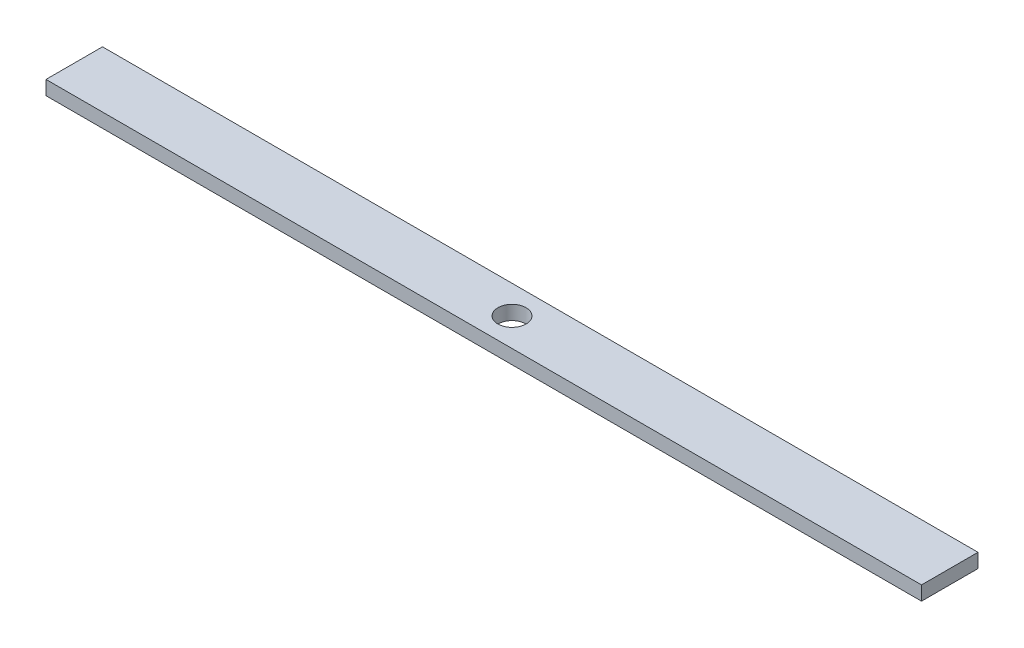
ISO-10303-21;
HEADER;
FILE_DESCRIPTION(('STEP AP214'),'2;1');
FILE_NAME('part.step','',(''),(''),'','','');
FILE_SCHEMA(('AUTOMOTIVE_DESIGN { 1 0 10303 214 1 1 1 1 }'));
ENDSEC;
DATA;
#1=APPLICATION_CONTEXT('core data for automotive mechanical design processes');
#2=APPLICATION_PROTOCOL_DEFINITION('international standard','automotive_design',2000,#1);
#3=PRODUCT_CONTEXT('',#1,'mechanical');
#4=PRODUCT('Part','Part','',(#3));
#5=PRODUCT_RELATED_PRODUCT_CATEGORY('part','',(#4));
#6=PRODUCT_DEFINITION_FORMATION('','',#4);
#7=PRODUCT_DEFINITION_CONTEXT('part definition',#1,'design');
#8=PRODUCT_DEFINITION('design','',#6,#7);
#9=PRODUCT_DEFINITION_SHAPE('','',#8);
#10=(LENGTH_UNIT() NAMED_UNIT(*) SI_UNIT(.MILLI.,.METRE.));
#11=(NAMED_UNIT(*) PLANE_ANGLE_UNIT() SI_UNIT($,.RADIAN.));
#12=(NAMED_UNIT(*) SI_UNIT($,.STERADIAN.) SOLID_ANGLE_UNIT());
#13=UNCERTAINTY_MEASURE_WITH_UNIT(LENGTH_MEASURE(1.E-05),#10,'distance_accuracy_value','');
#14=(GEOMETRIC_REPRESENTATION_CONTEXT(3) GLOBAL_UNCERTAINTY_ASSIGNED_CONTEXT((#13)) GLOBAL_UNIT_ASSIGNED_CONTEXT((#10,
#11,#12)) REPRESENTATION_CONTEXT('',''));
#15=CARTESIAN_POINT('',(0.,0.,0.));
#16=DIRECTION('',(0.,0.,1.));
#17=DIRECTION('',(1.,0.,0.));
#18=AXIS2_PLACEMENT_3D('',#15,#16,#17);
#19=CARTESIAN_POINT('',(0.,6.35,0.));
#20=DIRECTION('',(0.,1.,0.));
#21=DIRECTION('',(0.,0.,1.));
#22=AXIS2_PLACEMENT_3D('',#19,#20,#21);
#23=PLANE('',#22);
#24=DIRECTION('',(0.,0.,-1.));
#25=VECTOR('',#24,1.);
#26=CARTESIAN_POINT('',(196.85,6.35,-12.7));
#27=LINE('',#26,#25);
#28=CARTESIAN_POINT('',(196.85,6.35,12.7));
#29=VERTEX_POINT('',#28);
#30=CARTESIAN_POINT('',(196.85,6.35,-12.7));
#31=VERTEX_POINT('',#30);
#32=EDGE_CURVE('E92',#29,#31,#27,.T.);
#33=ORIENTED_EDGE('',*,*,#32,.T.);
#34=DIRECTION('',(-1.,0.,0.));
#35=VECTOR('',#34,1.);
#36=CARTESIAN_POINT('',(-196.85,6.35,-12.7));
#37=LINE('',#36,#35);
#38=CARTESIAN_POINT('',(-196.85,6.35,-12.7));
#39=VERTEX_POINT('',#38);
#40=EDGE_CURVE('E87',#31,#39,#37,.T.);
#41=ORIENTED_EDGE('',*,*,#40,.T.);
#42=DIRECTION('',(0.,0.,1.));
#43=VECTOR('',#42,1.);
#44=CARTESIAN_POINT('',(-196.85,6.35,-12.7));
#45=LINE('',#44,#43);
#46=CARTESIAN_POINT('',(-196.85,6.35,12.7));
#47=VERTEX_POINT('',#46);
#48=EDGE_CURVE('E90',#39,#47,#45,.T.);
#49=ORIENTED_EDGE('',*,*,#48,.T.);
#50=DIRECTION('',(1.,0.,0.));
#51=VECTOR('',#50,1.);
#52=CARTESIAN_POINT('',(-196.85,6.35,12.7));
#53=LINE('',#52,#51);
#54=EDGE_CURVE('E57',#47,#29,#53,.T.);
#55=ORIENTED_EDGE('',*,*,#54,.T.);
#56=EDGE_LOOP('',(#33,#41,#49,#55));
#57=FACE_BOUND('',#56,.T.);
#58=CARTESIAN_POINT('',(0.,6.35,0.));
#59=DIRECTION('',(0.,1.,0.));
#60=DIRECTION('',(0.,0.,1.));
#61=AXIS2_PLACEMENT_3D('',#58,#59,#60);
#62=CIRCLE('',#61,6.35);
#63=CARTESIAN_POINT('',(0.,6.35,6.35));
#64=VERTEX_POINT('',#63);
#65=EDGE_CURVE('E112',#64,#64,#62,.T.);
#66=ORIENTED_EDGE('',*,*,#65,.F.);
#67=EDGE_LOOP('',(#66));
#68=FACE_BOUND('',#67,.T.);
#69=ADVANCED_FACE('F39',(#57,#68),#23,.T.);
#70=CARTESIAN_POINT('',(0.,0.,0.));
#71=DIRECTION('',(0.,1.,0.));
#72=DIRECTION('',(0.,0.,1.));
#73=AXIS2_PLACEMENT_3D('',#70,#71,#72);
#74=PLANE('',#73);
#75=DIRECTION('',(0.,0.,-1.));
#76=VECTOR('',#75,1.);
#77=CARTESIAN_POINT('',(196.85,0.,-12.7));
#78=LINE('',#77,#76);
#79=CARTESIAN_POINT('',(196.85,0.,12.7));
#80=VERTEX_POINT('',#79);
#81=CARTESIAN_POINT('',(196.85,0.,-12.7));
#82=VERTEX_POINT('',#81);
#83=EDGE_CURVE('E108',#80,#82,#78,.T.);
#84=ORIENTED_EDGE('',*,*,#83,.F.);
#85=DIRECTION('',(1.,0.,0.));
#86=VECTOR('',#85,1.);
#87=CARTESIAN_POINT('',(-196.85,0.,12.7));
#88=LINE('',#87,#86);
#89=CARTESIAN_POINT('',(-196.85,0.,12.7));
#90=VERTEX_POINT('',#89);
#91=EDGE_CURVE('E80',#90,#80,#88,.T.);
#92=ORIENTED_EDGE('',*,*,#91,.F.);
#93=DIRECTION('',(0.,0.,1.));
#94=VECTOR('',#93,1.);
#95=CARTESIAN_POINT('',(-196.85,0.,-12.7));
#96=LINE('',#95,#94);
#97=CARTESIAN_POINT('',(-196.85,0.,-12.7));
#98=VERTEX_POINT('',#97);
#99=EDGE_CURVE('E74',#98,#90,#96,.T.);
#100=ORIENTED_EDGE('',*,*,#99,.F.);
#101=DIRECTION('',(-1.,0.,0.));
#102=VECTOR('',#101,1.);
#103=CARTESIAN_POINT('',(-196.85,0.,-12.7));
#104=LINE('',#103,#102);
#105=EDGE_CURVE('E97',#82,#98,#104,.T.);
#106=ORIENTED_EDGE('',*,*,#105,.F.);
#107=EDGE_LOOP('',(#84,#92,#100,#106));
#108=FACE_BOUND('',#107,.T.);
#109=CARTESIAN_POINT('',(0.,0.,0.));
#110=DIRECTION('',(0.,1.,0.));
#111=DIRECTION('',(0.,0.,1.));
#112=AXIS2_PLACEMENT_3D('',#109,#110,#111);
#113=CIRCLE('',#112,6.35);
#114=CARTESIAN_POINT('',(0.,0.,6.35));
#115=VERTEX_POINT('',#114);
#116=EDGE_CURVE('E130',#115,#115,#113,.T.);
#117=ORIENTED_EDGE('',*,*,#116,.T.);
#118=EDGE_LOOP('',(#117));
#119=FACE_BOUND('',#118,.T.);
#120=ADVANCED_FACE('F125',(#108,#119),#74,.F.);
#121=CARTESIAN_POINT('',(196.85,6.35,-12.7));
#122=DIRECTION('',(-1.,0.,0.));
#123=DIRECTION('',(0.,0.,1.));
#124=AXIS2_PLACEMENT_3D('',#121,#122,#123);
#125=PLANE('',#124);
#126=ORIENTED_EDGE('',*,*,#83,.T.);
#127=DIRECTION('',(0.,-1.,0.));
#128=VECTOR('',#127,1.);
#129=CARTESIAN_POINT('',(196.85,6.35,-12.7));
#130=LINE('',#129,#128);
#131=EDGE_CURVE('E11',#31,#82,#130,.T.);
#132=ORIENTED_EDGE('',*,*,#131,.F.);
#133=ORIENTED_EDGE('',*,*,#32,.F.);
#134=DIRECTION('',(0.,-1.,0.));
#135=VECTOR('',#134,1.);
#136=CARTESIAN_POINT('',(196.85,6.35,12.7));
#137=LINE('',#136,#135);
#138=EDGE_CURVE('E104',#29,#80,#137,.T.);
#139=ORIENTED_EDGE('',*,*,#138,.T.);
#140=EDGE_LOOP('',(#126,#132,#133,#139));
#141=FACE_BOUND('',#140,.T.);
#142=ADVANCED_FACE('F41',(#141),#125,.F.);
#143=CARTESIAN_POINT('',(-196.85,6.35,-12.7));
#144=DIRECTION('',(0.,0.,1.));
#145=DIRECTION('',(1.,0.,0.));
#146=AXIS2_PLACEMENT_3D('',#143,#144,#145);
#147=PLANE('',#146);
#148=ORIENTED_EDGE('',*,*,#105,.T.);
#149=DIRECTION('',(0.,-1.,0.));
#150=VECTOR('',#149,1.);
#151=CARTESIAN_POINT('',(-196.85,6.35,-12.7));
#152=LINE('',#151,#150);
#153=EDGE_CURVE('E49',#39,#98,#152,.T.);
#154=ORIENTED_EDGE('',*,*,#153,.F.);
#155=ORIENTED_EDGE('',*,*,#40,.F.);
#156=ORIENTED_EDGE('',*,*,#131,.T.);
#157=EDGE_LOOP('',(#148,#154,#155,#156));
#158=FACE_BOUND('',#157,.T.);
#159=ADVANCED_FACE('F96',(#158),#147,.F.);
#160=CARTESIAN_POINT('',(-196.85,6.35,-12.7));
#161=DIRECTION('',(1.,0.,0.));
#162=DIRECTION('',(0.,0.,-1.));
#163=AXIS2_PLACEMENT_3D('',#160,#161,#162);
#164=PLANE('',#163);
#165=ORIENTED_EDGE('',*,*,#99,.T.);
#166=DIRECTION('',(0.,-1.,0.));
#167=VECTOR('',#166,1.);
#168=CARTESIAN_POINT('',(-196.85,6.35,12.7));
#169=LINE('',#168,#167);
#170=EDGE_CURVE('E99',#47,#90,#169,.T.);
#171=ORIENTED_EDGE('',*,*,#170,.F.);
#172=ORIENTED_EDGE('',*,*,#48,.F.);
#173=ORIENTED_EDGE('',*,*,#153,.T.);
#174=EDGE_LOOP('',(#165,#171,#172,#173));
#175=FACE_BOUND('',#174,.T.);
#176=ADVANCED_FACE('F100',(#175),#164,.F.);
#177=CARTESIAN_POINT('',(-196.85,6.35,12.7));
#178=DIRECTION('',(0.,0.,-1.));
#179=DIRECTION('',(-1.,0.,0.));
#180=AXIS2_PLACEMENT_3D('',#177,#178,#179);
#181=PLANE('',#180);
#182=ORIENTED_EDGE('',*,*,#91,.T.);
#183=ORIENTED_EDGE('',*,*,#138,.F.);
#184=ORIENTED_EDGE('',*,*,#54,.F.);
#185=ORIENTED_EDGE('',*,*,#170,.T.);
#186=EDGE_LOOP('',(#182,#183,#184,#185));
#187=FACE_BOUND('',#186,.T.);
#188=ADVANCED_FACE('F122',(#187),#181,.F.);
#189=CARTESIAN_POINT('',(0.,6.35,0.));
#190=DIRECTION('',(0.,-1.,0.));
#191=DIRECTION('',(0.,0.,-1.));
#192=AXIS2_PLACEMENT_3D('',#189,#190,#191);
#193=CYLINDRICAL_SURFACE('',#192,6.35);
#194=ORIENTED_EDGE('',*,*,#65,.T.);
#195=EDGE_LOOP('',(#194));
#196=FACE_BOUND('',#195,.T.);
#197=ORIENTED_EDGE('',*,*,#116,.F.);
#198=EDGE_LOOP('',(#197));
#199=FACE_BOUND('',#198,.T.);
#200=ADVANCED_FACE('F138',(#196,#199),#193,.F.);
#201=CLOSED_SHELL('',(#69,#120,#142,#159,#176,#188,#200));
#202=MANIFOLD_SOLID_BREP('B2',#201);
#203=ADVANCED_BREP_SHAPE_REPRESENTATION('',(#18,#202),#14);
#204=SHAPE_DEFINITION_REPRESENTATION(#9,#203);
ENDSEC;
END-ISO-10303-21;
